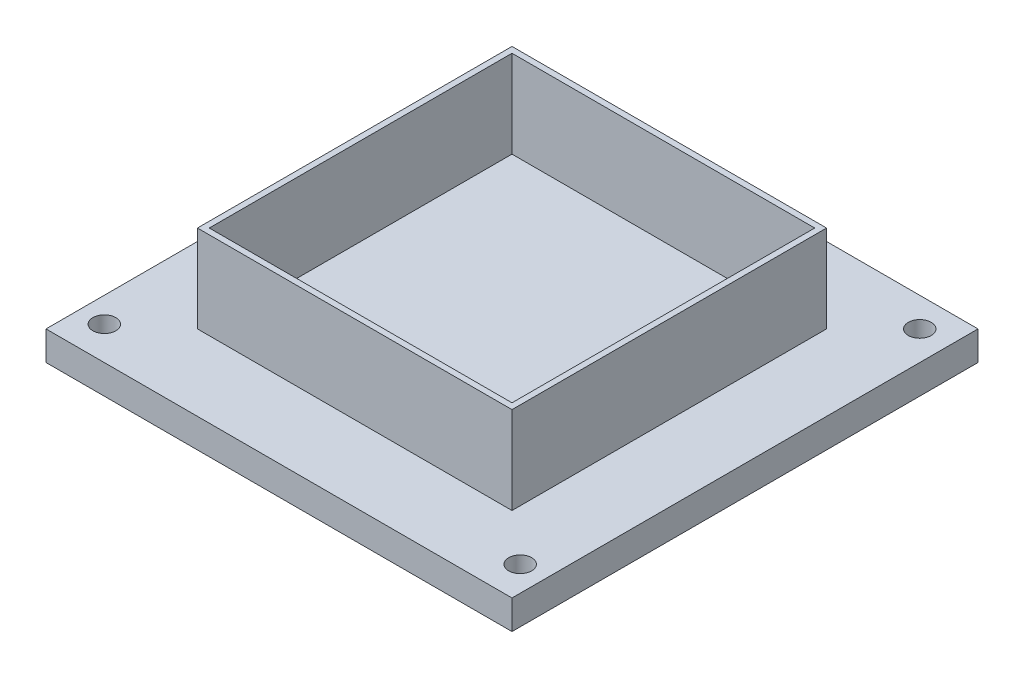
ISO-10303-21;
HEADER;
FILE_DESCRIPTION(('STEP AP214'),'2;1');
FILE_NAME('part.step','',(''),(''),'','','');
FILE_SCHEMA(('AUTOMOTIVE_DESIGN { 1 0 10303 214 1 1 1 1 }'));
ENDSEC;
DATA;
#1=APPLICATION_CONTEXT('core data for automotive mechanical design processes');
#2=APPLICATION_PROTOCOL_DEFINITION('international standard','automotive_design',2000,#1);
#3=PRODUCT_CONTEXT('',#1,'mechanical');
#4=PRODUCT('Part','Part','',(#3));
#5=PRODUCT_RELATED_PRODUCT_CATEGORY('part','',(#4));
#6=PRODUCT_DEFINITION_FORMATION('','',#4);
#7=PRODUCT_DEFINITION_CONTEXT('part definition',#1,'design');
#8=PRODUCT_DEFINITION('design','',#6,#7);
#9=PRODUCT_DEFINITION_SHAPE('','',#8);
#10=(LENGTH_UNIT() NAMED_UNIT(*) SI_UNIT(.MILLI.,.METRE.));
#11=(NAMED_UNIT(*) PLANE_ANGLE_UNIT() SI_UNIT($,.RADIAN.));
#12=(NAMED_UNIT(*) SI_UNIT($,.STERADIAN.) SOLID_ANGLE_UNIT());
#13=UNCERTAINTY_MEASURE_WITH_UNIT(LENGTH_MEASURE(1.E-05),#10,'distance_accuracy_value','');
#14=(GEOMETRIC_REPRESENTATION_CONTEXT(3) GLOBAL_UNCERTAINTY_ASSIGNED_CONTEXT((#13)) GLOBAL_UNIT_ASSIGNED_CONTEXT((#10,
#11,#12)) REPRESENTATION_CONTEXT('',''));
#15=CARTESIAN_POINT('',(0.,0.,0.));
#16=DIRECTION('',(0.,0.,1.));
#17=DIRECTION('',(1.,0.,0.));
#18=AXIS2_PLACEMENT_3D('',#15,#16,#17);
#19=CARTESIAN_POINT('',(0.,25.4,-33.));
#20=DIRECTION('',(0.,0.,-1.));
#21=DIRECTION('',(-1.,0.,0.));
#22=AXIS2_PLACEMENT_3D('',#19,#20,#21);
#23=PLANE('',#22);
#24=DIRECTION('',(-1.,0.,0.));
#25=VECTOR('',#24,1.);
#26=CARTESIAN_POINT('',(0.,6.35,-33.));
#27=LINE('',#26,#25);
#28=CARTESIAN_POINT('',(33.0000000000001,6.35,-33.));
#29=VERTEX_POINT('',#28);
#30=CARTESIAN_POINT('',(-33.0000000000001,6.35,-33.));
#31=VERTEX_POINT('',#30);
#32=EDGE_CURVE('E175',#29,#31,#27,.T.);
#33=ORIENTED_EDGE('',*,*,#32,.F.);
#34=DIRECTION('',(0.,-1.,0.));
#35=VECTOR('',#34,1.);
#36=CARTESIAN_POINT('',(33.0000000000001,25.4,-33.));
#37=LINE('',#36,#35);
#38=CARTESIAN_POINT('',(33.0000000000001,25.4,-33.));
#39=VERTEX_POINT('',#38);
#40=EDGE_CURVE('E44',#39,#29,#37,.T.);
#41=ORIENTED_EDGE('',*,*,#40,.F.);
#42=DIRECTION('',(1.,0.,0.));
#43=VECTOR('',#42,1.);
#44=CARTESIAN_POINT('',(0.,25.4,-33.));
#45=LINE('',#44,#43);
#46=CARTESIAN_POINT('',(-33.0000000000001,25.4,-33.));
#47=VERTEX_POINT('',#46);
#48=EDGE_CURVE('E195',#47,#39,#45,.T.);
#49=ORIENTED_EDGE('',*,*,#48,.F.);
#50=DIRECTION('',(0.,-1.,0.));
#51=VECTOR('',#50,1.);
#52=CARTESIAN_POINT('',(-33.0000000000001,25.4,-33.));
#53=LINE('',#52,#51);
#54=EDGE_CURVE('E207',#47,#31,#53,.T.);
#55=ORIENTED_EDGE('',*,*,#54,.T.);
#56=EDGE_LOOP('',(#33,#41,#49,#55));
#57=FACE_BOUND('',#56,.T.);
#58=ADVANCED_FACE('F36',(#57),#23,.F.);
#59=CARTESIAN_POINT('',(33.0000000000001,25.4,0.));
#60=DIRECTION('',(1.,0.,0.));
#61=DIRECTION('',(0.,0.,-1.));
#62=AXIS2_PLACEMENT_3D('',#59,#60,#61);
#63=PLANE('',#62);
#64=DIRECTION('',(0.,0.,-1.));
#65=VECTOR('',#64,1.);
#66=CARTESIAN_POINT('',(33.0000000000001,6.35,0.));
#67=LINE('',#66,#65);
#68=CARTESIAN_POINT('',(33.0000000000001,6.35,33.));
#69=VERTEX_POINT('',#68);
#70=EDGE_CURVE('E173',#69,#29,#67,.T.);
#71=ORIENTED_EDGE('',*,*,#70,.F.);
#72=DIRECTION('',(0.,-1.,0.));
#73=VECTOR('',#72,1.);
#74=CARTESIAN_POINT('',(33.0000000000001,25.4,33.));
#75=LINE('',#74,#73);
#76=CARTESIAN_POINT('',(33.0000000000001,25.4,33.));
#77=VERTEX_POINT('',#76);
#78=EDGE_CURVE('E214',#77,#69,#75,.T.);
#79=ORIENTED_EDGE('',*,*,#78,.F.);
#80=DIRECTION('',(0.,0.,1.));
#81=VECTOR('',#80,1.);
#82=CARTESIAN_POINT('',(33.0000000000001,25.4,0.));
#83=LINE('',#82,#81);
#84=EDGE_CURVE('E198',#39,#77,#83,.T.);
#85=ORIENTED_EDGE('',*,*,#84,.F.);
#86=ORIENTED_EDGE('',*,*,#40,.T.);
#87=EDGE_LOOP('',(#71,#79,#85,#86));
#88=FACE_BOUND('',#87,.T.);
#89=ADVANCED_FACE('F251',(#88),#63,.F.);
#90=CARTESIAN_POINT('',(0.,25.4,33.));
#91=DIRECTION('',(0.,0.,-1.));
#92=DIRECTION('',(-1.,0.,0.));
#93=AXIS2_PLACEMENT_3D('',#90,#91,#92);
#94=PLANE('',#93);
#95=ORIENTED_EDGE('',*,*,#78,.T.);
#96=DIRECTION('',(-1.,0.,0.));
#97=VECTOR('',#96,1.);
#98=CARTESIAN_POINT('',(0.,6.35,33.));
#99=LINE('',#98,#97);
#100=CARTESIAN_POINT('',(-33.0000000000001,6.35,33.));
#101=VERTEX_POINT('',#100);
#102=EDGE_CURVE('E148',#69,#101,#99,.T.);
#103=ORIENTED_EDGE('',*,*,#102,.T.);
#104=DIRECTION('',(0.,-1.,0.));
#105=VECTOR('',#104,1.);
#106=CARTESIAN_POINT('',(-33.0000000000001,25.4,33.));
#107=LINE('',#106,#105);
#108=CARTESIAN_POINT('',(-33.0000000000001,25.4,33.));
#109=VERTEX_POINT('',#108);
#110=EDGE_CURVE('E210',#109,#101,#107,.T.);
#111=ORIENTED_EDGE('',*,*,#110,.F.);
#112=DIRECTION('',(1.,0.,0.));
#113=VECTOR('',#112,1.);
#114=CARTESIAN_POINT('',(0.,25.4,33.));
#115=LINE('',#114,#113);
#116=EDGE_CURVE('E200',#109,#77,#115,.T.);
#117=ORIENTED_EDGE('',*,*,#116,.T.);
#118=EDGE_LOOP('',(#95,#103,#111,#117));
#119=FACE_BOUND('',#118,.T.);
#120=ADVANCED_FACE('F256',(#119),#94,.T.);
#121=CARTESIAN_POINT('',(34.2900000000001,25.4,0.));
#122=DIRECTION('',(1.,0.,0.));
#123=DIRECTION('',(0.,0.,-1.));
#124=AXIS2_PLACEMENT_3D('',#121,#122,#123);
#125=PLANE('',#124);
#126=DIRECTION('',(0.,-1.,0.));
#127=VECTOR('',#126,1.);
#128=CARTESIAN_POINT('',(34.2900000000001,25.4,34.29));
#129=LINE('',#128,#127);
#130=CARTESIAN_POINT('',(34.2900000000001,25.4,34.29));
#131=VERTEX_POINT('',#130);
#132=CARTESIAN_POINT('',(34.2900000000001,6.35,34.29));
#133=VERTEX_POINT('',#132);
#134=EDGE_CURVE('E206',#131,#133,#129,.T.);
#135=ORIENTED_EDGE('',*,*,#134,.T.);
#136=DIRECTION('',(0.,0.,-1.));
#137=VECTOR('',#136,1.);
#138=CARTESIAN_POINT('',(34.2900000000001,6.35,0.));
#139=LINE('',#138,#137);
#140=CARTESIAN_POINT('',(34.2900000000001,6.35,-34.29));
#141=VERTEX_POINT('',#140);
#142=EDGE_CURVE('E51',#133,#141,#139,.T.);
#143=ORIENTED_EDGE('',*,*,#142,.T.);
#144=DIRECTION('',(0.,-1.,0.));
#145=VECTOR('',#144,1.);
#146=CARTESIAN_POINT('',(34.2900000000001,25.4,-34.29));
#147=LINE('',#146,#145);
#148=CARTESIAN_POINT('',(34.2900000000001,25.4,-34.29));
#149=VERTEX_POINT('',#148);
#150=EDGE_CURVE('E211',#149,#141,#147,.T.);
#151=ORIENTED_EDGE('',*,*,#150,.F.);
#152=DIRECTION('',(0.,0.,1.));
#153=VECTOR('',#152,1.);
#154=CARTESIAN_POINT('',(34.2900000000001,25.4,0.));
#155=LINE('',#154,#153);
#156=EDGE_CURVE('E185',#149,#131,#155,.T.);
#157=ORIENTED_EDGE('',*,*,#156,.T.);
#158=EDGE_LOOP('',(#135,#143,#151,#157));
#159=FACE_BOUND('',#158,.T.);
#160=ADVANCED_FACE('F38',(#159),#125,.T.);
#161=CARTESIAN_POINT('',(0.,25.4,-34.29));
#162=DIRECTION('',(0.,0.,-1.));
#163=DIRECTION('',(-1.,0.,0.));
#164=AXIS2_PLACEMENT_3D('',#161,#162,#163);
#165=PLANE('',#164);
#166=ORIENTED_EDGE('',*,*,#150,.T.);
#167=DIRECTION('',(-1.,0.,0.));
#168=VECTOR('',#167,1.);
#169=CARTESIAN_POINT('',(0.,6.35,-34.29));
#170=LINE('',#169,#168);
#171=CARTESIAN_POINT('',(-34.2900000000002,6.35,-34.29));
#172=VERTEX_POINT('',#171);
#173=EDGE_CURVE('E58',#141,#172,#170,.T.);
#174=ORIENTED_EDGE('',*,*,#173,.T.);
#175=DIRECTION('',(0.,-1.,0.));
#176=VECTOR('',#175,1.);
#177=CARTESIAN_POINT('',(-34.2900000000002,25.4,-34.29));
#178=LINE('',#177,#176);
#179=CARTESIAN_POINT('',(-34.2900000000002,25.4,-34.29));
#180=VERTEX_POINT('',#179);
#181=EDGE_CURVE('E222',#180,#172,#178,.T.);
#182=ORIENTED_EDGE('',*,*,#181,.F.);
#183=DIRECTION('',(1.,0.,0.));
#184=VECTOR('',#183,1.);
#185=CARTESIAN_POINT('',(0.,25.4,-34.29));
#186=LINE('',#185,#184);
#187=EDGE_CURVE('E188',#180,#149,#186,.T.);
#188=ORIENTED_EDGE('',*,*,#187,.T.);
#189=EDGE_LOOP('',(#166,#174,#182,#188));
#190=FACE_BOUND('',#189,.T.);
#191=ADVANCED_FACE('F223',(#190),#165,.T.);
#192=CARTESIAN_POINT('',(-34.2900000000002,25.4,0.));
#193=DIRECTION('',(1.,0.,0.));
#194=DIRECTION('',(0.,0.,-1.));
#195=AXIS2_PLACEMENT_3D('',#192,#193,#194);
#196=PLANE('',#195);
#197=DIRECTION('',(0.,0.,-1.));
#198=VECTOR('',#197,1.);
#199=CARTESIAN_POINT('',(-34.2900000000002,6.35,0.));
#200=LINE('',#199,#198);
#201=CARTESIAN_POINT('',(-34.2900000000002,6.35,34.29));
#202=VERTEX_POINT('',#201);
#203=EDGE_CURVE('E180',#202,#172,#200,.T.);
#204=ORIENTED_EDGE('',*,*,#203,.F.);
#205=DIRECTION('',(0.,-1.,0.));
#206=VECTOR('',#205,1.);
#207=CARTESIAN_POINT('',(-34.2900000000002,25.4,34.29));
#208=LINE('',#207,#206);
#209=CARTESIAN_POINT('',(-34.2900000000002,25.4,34.29));
#210=VERTEX_POINT('',#209);
#211=EDGE_CURVE('E220',#210,#202,#208,.T.);
#212=ORIENTED_EDGE('',*,*,#211,.F.);
#213=DIRECTION('',(0.,0.,1.));
#214=VECTOR('',#213,1.);
#215=CARTESIAN_POINT('',(-34.2900000000002,25.4,0.));
#216=LINE('',#215,#214);
#217=EDGE_CURVE('E191',#180,#210,#216,.T.);
#218=ORIENTED_EDGE('',*,*,#217,.F.);
#219=ORIENTED_EDGE('',*,*,#181,.T.);
#220=EDGE_LOOP('',(#204,#212,#218,#219));
#221=FACE_BOUND('',#220,.T.);
#222=ADVANCED_FACE('F230',(#221),#196,.F.);
#223=CARTESIAN_POINT('',(0.,25.4,34.29));
#224=DIRECTION('',(0.,0.,-1.));
#225=DIRECTION('',(-1.,0.,0.));
#226=AXIS2_PLACEMENT_3D('',#223,#224,#225);
#227=PLANE('',#226);
#228=DIRECTION('',(-1.,0.,0.));
#229=VECTOR('',#228,1.);
#230=CARTESIAN_POINT('',(0.,6.35,34.29));
#231=LINE('',#230,#229);
#232=EDGE_CURVE('E177',#133,#202,#231,.T.);
#233=ORIENTED_EDGE('',*,*,#232,.F.);
#234=ORIENTED_EDGE('',*,*,#134,.F.);
#235=DIRECTION('',(1.,0.,0.));
#236=VECTOR('',#235,1.);
#237=CARTESIAN_POINT('',(0.,25.4,34.29));
#238=LINE('',#237,#236);
#239=EDGE_CURVE('E193',#210,#131,#238,.T.);
#240=ORIENTED_EDGE('',*,*,#239,.F.);
#241=ORIENTED_EDGE('',*,*,#211,.T.);
#242=EDGE_LOOP('',(#233,#234,#240,#241));
#243=FACE_BOUND('',#242,.T.);
#244=ADVANCED_FACE('F238',(#243),#227,.F.);
#245=CARTESIAN_POINT('',(-33.0000000000001,25.4,0.));
#246=DIRECTION('',(1.,0.,0.));
#247=DIRECTION('',(0.,0.,-1.));
#248=AXIS2_PLACEMENT_3D('',#245,#246,#247);
#249=PLANE('',#248);
#250=ORIENTED_EDGE('',*,*,#110,.T.);
#251=DIRECTION('',(0.,0.,-1.));
#252=VECTOR('',#251,1.);
#253=CARTESIAN_POINT('',(-33.0000000000001,6.35,0.));
#254=LINE('',#253,#252);
#255=EDGE_CURVE('E11',#101,#31,#254,.T.);
#256=ORIENTED_EDGE('',*,*,#255,.T.);
#257=ORIENTED_EDGE('',*,*,#54,.F.);
#258=DIRECTION('',(0.,0.,1.));
#259=VECTOR('',#258,1.);
#260=CARTESIAN_POINT('',(-33.0000000000001,25.4,0.));
#261=LINE('',#260,#259);
#262=EDGE_CURVE('E203',#47,#109,#261,.T.);
#263=ORIENTED_EDGE('',*,*,#262,.T.);
#264=EDGE_LOOP('',(#250,#256,#257,#263));
#265=FACE_BOUND('',#264,.T.);
#266=ADVANCED_FACE('F240',(#265),#249,.T.);
#267=CARTESIAN_POINT('',(0.,25.4,0.));
#268=DIRECTION('',(0.,1.,0.));
#269=DIRECTION('',(0.,0.,1.));
#270=AXIS2_PLACEMENT_3D('',#267,#268,#269);
#271=PLANE('',#270);
#272=ORIENTED_EDGE('',*,*,#156,.F.);
#273=ORIENTED_EDGE('',*,*,#187,.F.);
#274=ORIENTED_EDGE('',*,*,#217,.T.);
#275=ORIENTED_EDGE('',*,*,#239,.T.);
#276=EDGE_LOOP('',(#272,#273,#274,#275));
#277=FACE_BOUND('',#276,.T.);
#278=ORIENTED_EDGE('',*,*,#48,.T.);
#279=ORIENTED_EDGE('',*,*,#84,.T.);
#280=ORIENTED_EDGE('',*,*,#116,.F.);
#281=ORIENTED_EDGE('',*,*,#262,.F.);
#282=EDGE_LOOP('',(#278,#279,#280,#281));
#283=FACE_BOUND('',#282,.T.);
#284=ADVANCED_FACE('F234',(#277,#283),#271,.T.);
#285=CARTESIAN_POINT('',(0.,6.35,0.));
#286=DIRECTION('',(0.,-1.,0.));
#287=DIRECTION('',(0.,0.,-1.));
#288=AXIS2_PLACEMENT_3D('',#285,#286,#287);
#289=PLANE('',#288);
#290=ORIENTED_EDGE('',*,*,#70,.T.);
#291=ORIENTED_EDGE('',*,*,#32,.T.);
#292=ORIENTED_EDGE('',*,*,#255,.F.);
#293=ORIENTED_EDGE('',*,*,#102,.F.);
#294=EDGE_LOOP('',(#290,#291,#292,#293));
#295=FACE_BOUND('',#294,.T.);
#296=ADVANCED_FACE('F271',(#295),#289,.F.);
#297=CARTESIAN_POINT('',(-50.8,6.35,50.8));
#298=DIRECTION('',(0.,0.,-1.));
#299=DIRECTION('',(-1.,0.,0.));
#300=AXIS2_PLACEMENT_3D('',#297,#298,#299);
#301=PLANE('',#300);
#302=DIRECTION('',(1.,0.,0.));
#303=VECTOR('',#302,1.);
#304=CARTESIAN_POINT('',(-50.8,0.,50.8));
#305=LINE('',#304,#303);
#306=CARTESIAN_POINT('',(-50.8,0.,50.8));
#307=VERTEX_POINT('',#306);
#308=CARTESIAN_POINT('',(50.8,0.,50.8));
#309=VERTEX_POINT('',#308);
#310=EDGE_CURVE('E144',#307,#309,#305,.T.);
#311=ORIENTED_EDGE('',*,*,#310,.T.);
#312=DIRECTION('',(0.,-1.,0.));
#313=VECTOR('',#312,1.);
#314=CARTESIAN_POINT('',(50.8,6.35,50.8));
#315=LINE('',#314,#313);
#316=CARTESIAN_POINT('',(50.8,6.35,50.8));
#317=VERTEX_POINT('',#316);
#318=EDGE_CURVE('E141',#317,#309,#315,.T.);
#319=ORIENTED_EDGE('',*,*,#318,.F.);
#320=DIRECTION('',(1.,0.,0.));
#321=VECTOR('',#320,1.);
#322=CARTESIAN_POINT('',(-50.8,6.35,50.8));
#323=LINE('',#322,#321);
#324=CARTESIAN_POINT('',(-50.8,6.35,50.8));
#325=VERTEX_POINT('',#324);
#326=EDGE_CURVE('E126',#325,#317,#323,.T.);
#327=ORIENTED_EDGE('',*,*,#326,.F.);
#328=DIRECTION('',(0.,-1.,0.));
#329=VECTOR('',#328,1.);
#330=CARTESIAN_POINT('',(-50.8,6.35,50.8));
#331=LINE('',#330,#329);
#332=EDGE_CURVE('E158',#325,#307,#331,.T.);
#333=ORIENTED_EDGE('',*,*,#332,.T.);
#334=EDGE_LOOP('',(#311,#319,#327,#333));
#335=FACE_BOUND('',#334,.T.);
#336=ADVANCED_FACE('F142',(#335),#301,.F.);
#337=CARTESIAN_POINT('',(50.8,6.35,-50.8));
#338=DIRECTION('',(1.,0.,0.));
#339=DIRECTION('',(0.,0.,-1.));
#340=AXIS2_PLACEMENT_3D('',#337,#338,#339);
#341=PLANE('',#340);
#342=DIRECTION('',(0.,0.,1.));
#343=VECTOR('',#342,1.);
#344=CARTESIAN_POINT('',(50.8,0.,-50.8));
#345=LINE('',#344,#343);
#346=CARTESIAN_POINT('',(50.8,0.,-50.8));
#347=VERTEX_POINT('',#346);
#348=EDGE_CURVE('E160',#347,#309,#345,.T.);
#349=ORIENTED_EDGE('',*,*,#348,.F.);
#350=DIRECTION('',(0.,-1.,0.));
#351=VECTOR('',#350,1.);
#352=CARTESIAN_POINT('',(50.8,6.35,-50.8));
#353=LINE('',#352,#351);
#354=CARTESIAN_POINT('',(50.8,6.35,-50.8));
#355=VERTEX_POINT('',#354);
#356=EDGE_CURVE('E149',#355,#347,#353,.T.);
#357=ORIENTED_EDGE('',*,*,#356,.F.);
#358=DIRECTION('',(0.,0.,1.));
#359=VECTOR('',#358,1.);
#360=CARTESIAN_POINT('',(50.8,6.35,-50.8));
#361=LINE('',#360,#359);
#362=EDGE_CURVE('E131',#355,#317,#361,.T.);
#363=ORIENTED_EDGE('',*,*,#362,.T.);
#364=ORIENTED_EDGE('',*,*,#318,.T.);
#365=EDGE_LOOP('',(#349,#357,#363,#364));
#366=FACE_BOUND('',#365,.T.);
#367=ADVANCED_FACE('F151',(#366),#341,.T.);
#368=CARTESIAN_POINT('',(-50.8,6.35,-50.8));
#369=DIRECTION('',(0.,0.,-1.));
#370=DIRECTION('',(-1.,0.,0.));
#371=AXIS2_PLACEMENT_3D('',#368,#369,#370);
#372=PLANE('',#371);
#373=DIRECTION('',(1.,0.,0.));
#374=VECTOR('',#373,1.);
#375=CARTESIAN_POINT('',(-50.8,0.,-50.8));
#376=LINE('',#375,#374);
#377=CARTESIAN_POINT('',(-50.8,0.,-50.8));
#378=VERTEX_POINT('',#377);
#379=EDGE_CURVE('E163',#378,#347,#376,.T.);
#380=ORIENTED_EDGE('',*,*,#379,.F.);
#381=DIRECTION('',(0.,-1.,0.));
#382=VECTOR('',#381,1.);
#383=CARTESIAN_POINT('',(-50.8,6.35,-50.8));
#384=LINE('',#383,#382);
#385=CARTESIAN_POINT('',(-50.8,6.35,-50.8));
#386=VERTEX_POINT('',#385);
#387=EDGE_CURVE('E168',#386,#378,#384,.T.);
#388=ORIENTED_EDGE('',*,*,#387,.F.);
#389=DIRECTION('',(1.,0.,0.));
#390=VECTOR('',#389,1.);
#391=CARTESIAN_POINT('',(-50.8,6.35,-50.8));
#392=LINE('',#391,#390);
#393=EDGE_CURVE('E152',#386,#355,#392,.T.);
#394=ORIENTED_EDGE('',*,*,#393,.T.);
#395=ORIENTED_EDGE('',*,*,#356,.T.);
#396=EDGE_LOOP('',(#380,#388,#394,#395));
#397=FACE_BOUND('',#396,.T.);
#398=ADVANCED_FACE('F276',(#397),#372,.T.);
#399=CARTESIAN_POINT('',(-50.8,6.35,-50.8));
#400=DIRECTION('',(1.,0.,0.));
#401=DIRECTION('',(0.,0.,-1.));
#402=AXIS2_PLACEMENT_3D('',#399,#400,#401);
#403=PLANE('',#402);
#404=DIRECTION('',(0.,0.,1.));
#405=VECTOR('',#404,1.);
#406=CARTESIAN_POINT('',(-50.8,0.,-50.8));
#407=LINE('',#406,#405);
#408=EDGE_CURVE('E138',#378,#307,#407,.T.);
#409=ORIENTED_EDGE('',*,*,#408,.T.);
#410=ORIENTED_EDGE('',*,*,#332,.F.);
#411=DIRECTION('',(0.,0.,1.));
#412=VECTOR('',#411,1.);
#413=CARTESIAN_POINT('',(-50.8,6.35,-50.8));
#414=LINE('',#413,#412);
#415=EDGE_CURVE('E134',#386,#325,#414,.T.);
#416=ORIENTED_EDGE('',*,*,#415,.F.);
#417=ORIENTED_EDGE('',*,*,#387,.T.);
#418=EDGE_LOOP('',(#409,#410,#416,#417));
#419=FACE_BOUND('',#418,.T.);
#420=ADVANCED_FACE('F279',(#419),#403,.F.);
#421=CARTESIAN_POINT('',(44.45,6.35,-44.45));
#422=DIRECTION('',(0.,1.,0.));
#423=DIRECTION('',(0.,0.,-1.));
#424=AXIS2_PLACEMENT_3D('',#421,#422,#423);
#425=CIRCLE('',#424,2.5);
#426=CARTESIAN_POINT('',(44.45,6.35,-46.95));
#427=VERTEX_POINT('',#426);
#428=EDGE_CURVE('E324',#427,#427,#425,.T.);
#429=ORIENTED_EDGE('',*,*,#428,.F.);
#430=EDGE_LOOP('',(#429));
#431=FACE_BOUND('',#430,.T.);
#432=CARTESIAN_POINT('',(45.3317742135824,6.35,43.550375964494));
#433=DIRECTION('',(0.,1.,0.));
#434=DIRECTION('',(0.,0.,1.));
#435=AXIS2_PLACEMENT_3D('',#432,#433,#434);
#436=CIRCLE('',#435,2.50000000000001);
#437=CARTESIAN_POINT('',(45.3317742135824,6.35,46.050375964494));
#438=VERTEX_POINT('',#437);
#439=EDGE_CURVE('E316',#438,#438,#436,.T.);
#440=ORIENTED_EDGE('',*,*,#439,.F.);
#441=EDGE_LOOP('',(#440));
#442=FACE_BOUND('',#441,.T.);
#443=CARTESIAN_POINT('',(-45.3317742135824,6.35,43.550375964494));
#444=DIRECTION('',(0.,1.,0.));
#445=DIRECTION('',(0.,0.,-1.));
#446=AXIS2_PLACEMENT_3D('',#443,#444,#445);
#447=CIRCLE('',#446,2.50000000000001);
#448=CARTESIAN_POINT('',(-45.3317742135824,6.35,41.050375964494));
#449=VERTEX_POINT('',#448);
#450=EDGE_CURVE('E309',#449,#449,#447,.T.);
#451=ORIENTED_EDGE('',*,*,#450,.F.);
#452=EDGE_LOOP('',(#451));
#453=FACE_BOUND('',#452,.T.);
#454=CARTESIAN_POINT('',(-44.45,6.35,-44.45));
#455=DIRECTION('',(0.,1.,0.));
#456=DIRECTION('',(0.,0.,1.));
#457=AXIS2_PLACEMENT_3D('',#454,#455,#456);
#458=CIRCLE('',#457,2.5);
#459=CARTESIAN_POINT('',(-44.45,6.35,-41.95));
#460=VERTEX_POINT('',#459);
#461=EDGE_CURVE('E313',#460,#460,#458,.T.);
#462=ORIENTED_EDGE('',*,*,#461,.F.);
#463=EDGE_LOOP('',(#462));
#464=FACE_BOUND('',#463,.T.);
#465=ORIENTED_EDGE('',*,*,#142,.F.);
#466=ORIENTED_EDGE('',*,*,#232,.T.);
#467=ORIENTED_EDGE('',*,*,#203,.T.);
#468=ORIENTED_EDGE('',*,*,#173,.F.);
#469=EDGE_LOOP('',(#465,#466,#467,#468));
#470=FACE_BOUND('',#469,.T.);
#471=ORIENTED_EDGE('',*,*,#326,.T.);
#472=ORIENTED_EDGE('',*,*,#362,.F.);
#473=ORIENTED_EDGE('',*,*,#393,.F.);
#474=ORIENTED_EDGE('',*,*,#415,.T.);
#475=EDGE_LOOP('',(#471,#472,#473,#474));
#476=FACE_BOUND('',#475,.T.);
#477=ADVANCED_FACE('F128',(#431,#442,#453,#464,#470,#476),#289,.F.);
#478=CARTESIAN_POINT('',(0.,0.,0.));
#479=DIRECTION('',(0.,1.,0.));
#480=DIRECTION('',(0.,0.,1.));
#481=AXIS2_PLACEMENT_3D('',#478,#479,#480);
#482=PLANE('',#481);
#483=CARTESIAN_POINT('',(44.45,0.,-44.45));
#484=DIRECTION('',(0.,1.,0.));
#485=DIRECTION('',(0.,0.,-1.));
#486=AXIS2_PLACEMENT_3D('',#483,#484,#485);
#487=CIRCLE('',#486,2.5);
#488=CARTESIAN_POINT('',(44.45,0.,-46.95));
#489=VERTEX_POINT('',#488);
#490=EDGE_CURVE('E321',#489,#489,#487,.T.);
#491=ORIENTED_EDGE('',*,*,#490,.T.);
#492=EDGE_LOOP('',(#491));
#493=FACE_BOUND('',#492,.T.);
#494=CARTESIAN_POINT('',(45.3317742135824,0.,43.550375964494));
#495=DIRECTION('',(0.,1.,0.));
#496=DIRECTION('',(0.,0.,1.));
#497=AXIS2_PLACEMENT_3D('',#494,#495,#496);
#498=CIRCLE('',#497,2.50000000000001);
#499=CARTESIAN_POINT('',(45.3317742135824,0.,46.050375964494));
#500=VERTEX_POINT('',#499);
#501=EDGE_CURVE('E311',#500,#500,#498,.T.);
#502=ORIENTED_EDGE('',*,*,#501,.T.);
#503=EDGE_LOOP('',(#502));
#504=FACE_BOUND('',#503,.T.);
#505=CARTESIAN_POINT('',(-45.3317742135824,0.,43.550375964494));
#506=DIRECTION('',(0.,1.,0.));
#507=DIRECTION('',(0.,0.,-1.));
#508=AXIS2_PLACEMENT_3D('',#505,#506,#507);
#509=CIRCLE('',#508,2.50000000000001);
#510=CARTESIAN_POINT('',(-45.3317742135824,0.,41.050375964494));
#511=VERTEX_POINT('',#510);
#512=EDGE_CURVE('E306',#511,#511,#509,.T.);
#513=ORIENTED_EDGE('',*,*,#512,.T.);
#514=EDGE_LOOP('',(#513));
#515=FACE_BOUND('',#514,.T.);
#516=CARTESIAN_POINT('',(-44.45,0.,-44.45));
#517=DIRECTION('',(0.,1.,0.));
#518=DIRECTION('',(0.,0.,1.));
#519=AXIS2_PLACEMENT_3D('',#516,#517,#518);
#520=CIRCLE('',#519,2.5);
#521=CARTESIAN_POINT('',(-44.45,0.,-41.95));
#522=VERTEX_POINT('',#521);
#523=EDGE_CURVE('E161',#522,#522,#520,.T.);
#524=ORIENTED_EDGE('',*,*,#523,.T.);
#525=EDGE_LOOP('',(#524));
#526=FACE_BOUND('',#525,.T.);
#527=ORIENTED_EDGE('',*,*,#310,.F.);
#528=ORIENTED_EDGE('',*,*,#408,.F.);
#529=ORIENTED_EDGE('',*,*,#379,.T.);
#530=ORIENTED_EDGE('',*,*,#348,.T.);
#531=EDGE_LOOP('',(#527,#528,#529,#530));
#532=FACE_BOUND('',#531,.T.);
#533=ADVANCED_FACE('F264',(#493,#504,#515,#526,#532),#482,.F.);
#534=CARTESIAN_POINT('',(-44.45,0.,-44.45));
#535=DIRECTION('',(0.,1.,0.));
#536=DIRECTION('',(0.,0.,1.));
#537=AXIS2_PLACEMENT_3D('',#534,#535,#536);
#538=CYLINDRICAL_SURFACE('',#537,2.5);
#539=ORIENTED_EDGE('',*,*,#523,.F.);
#540=EDGE_LOOP('',(#539));
#541=FACE_BOUND('',#540,.T.);
#542=ORIENTED_EDGE('',*,*,#461,.T.);
#543=EDGE_LOOP('',(#542));
#544=FACE_BOUND('',#543,.T.);
#545=ADVANCED_FACE('F267',(#541,#544),#538,.F.);
#546=CARTESIAN_POINT('',(-45.3317742135824,0.,43.550375964494));
#547=DIRECTION('',(0.,1.,0.));
#548=DIRECTION('',(0.,0.,1.));
#549=AXIS2_PLACEMENT_3D('',#546,#547,#548);
#550=CYLINDRICAL_SURFACE('',#549,2.50000000000001);
#551=ORIENTED_EDGE('',*,*,#512,.F.);
#552=EDGE_LOOP('',(#551));
#553=FACE_BOUND('',#552,.T.);
#554=ORIENTED_EDGE('',*,*,#450,.T.);
#555=EDGE_LOOP('',(#554));
#556=FACE_BOUND('',#555,.T.);
#557=ADVANCED_FACE('F289',(#553,#556),#550,.F.);
#558=CARTESIAN_POINT('',(45.3317742135824,0.,43.550375964494));
#559=DIRECTION('',(0.,1.,0.));
#560=DIRECTION('',(0.,0.,1.));
#561=AXIS2_PLACEMENT_3D('',#558,#559,#560);
#562=CYLINDRICAL_SURFACE('',#561,2.50000000000001);
#563=ORIENTED_EDGE('',*,*,#501,.F.);
#564=EDGE_LOOP('',(#563));
#565=FACE_BOUND('',#564,.T.);
#566=ORIENTED_EDGE('',*,*,#439,.T.);
#567=EDGE_LOOP('',(#566));
#568=FACE_BOUND('',#567,.T.);
#569=ADVANCED_FACE('F294',(#565,#568),#562,.F.);
#570=CARTESIAN_POINT('',(44.45,0.,-44.45));
#571=DIRECTION('',(0.,1.,0.));
#572=DIRECTION('',(0.,0.,1.));
#573=AXIS2_PLACEMENT_3D('',#570,#571,#572);
#574=CYLINDRICAL_SURFACE('',#573,2.5);
#575=ORIENTED_EDGE('',*,*,#490,.F.);
#576=EDGE_LOOP('',(#575));
#577=FACE_BOUND('',#576,.T.);
#578=ORIENTED_EDGE('',*,*,#428,.T.);
#579=EDGE_LOOP('',(#578));
#580=FACE_BOUND('',#579,.T.);
#581=ADVANCED_FACE('F291',(#577,#580),#574,.F.);
#582=CLOSED_SHELL('',(#58,#89,#120,#160,#191,#222,#244,#266,#284,#296,#336,#367,#398,#420,#477,
#533,#545,#557,#569,#581));
#583=MANIFOLD_SOLID_BREP('B2',#582);
#584=ADVANCED_BREP_SHAPE_REPRESENTATION('',(#18,#583),#14);
#585=SHAPE_DEFINITION_REPRESENTATION(#9,#584);
ENDSEC;
END-ISO-10303-21;
